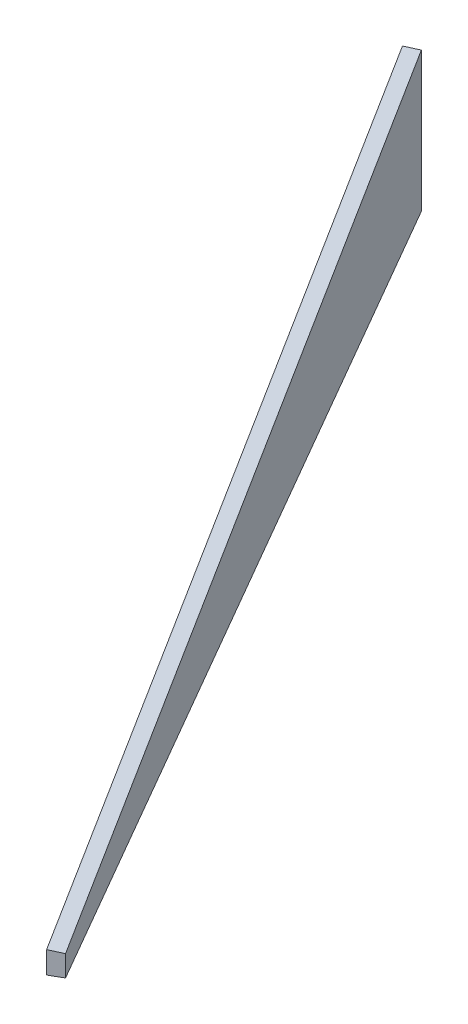
ISO-10303-21;
HEADER;
FILE_DESCRIPTION(('STEP AP214'),'2;1');
FILE_NAME('part.step','',(''),(''),'','','');
FILE_SCHEMA(('AUTOMOTIVE_DESIGN { 1 0 10303 214 1 1 1 1 }'));
ENDSEC;
DATA;
#1=APPLICATION_CONTEXT('core data for automotive mechanical design processes');
#2=APPLICATION_PROTOCOL_DEFINITION('international standard','automotive_design',2000,#1);
#3=PRODUCT_CONTEXT('',#1,'mechanical');
#4=PRODUCT('Part','Part','',(#3));
#5=PRODUCT_RELATED_PRODUCT_CATEGORY('part','',(#4));
#6=PRODUCT_DEFINITION_FORMATION('','',#4);
#7=PRODUCT_DEFINITION_CONTEXT('part definition',#1,'design');
#8=PRODUCT_DEFINITION('design','',#6,#7);
#9=PRODUCT_DEFINITION_SHAPE('','',#8);
#10=(LENGTH_UNIT() NAMED_UNIT(*) SI_UNIT(.MILLI.,.METRE.));
#11=(NAMED_UNIT(*) PLANE_ANGLE_UNIT() SI_UNIT($,.RADIAN.));
#12=(NAMED_UNIT(*) SI_UNIT($,.STERADIAN.) SOLID_ANGLE_UNIT());
#13=UNCERTAINTY_MEASURE_WITH_UNIT(LENGTH_MEASURE(1.E-05),#10,'distance_accuracy_value','');
#14=(GEOMETRIC_REPRESENTATION_CONTEXT(3) GLOBAL_UNCERTAINTY_ASSIGNED_CONTEXT((#13)) GLOBAL_UNIT_ASSIGNED_CONTEXT((#10,
#11,#12)) REPRESENTATION_CONTEXT('',''));
#15=CARTESIAN_POINT('',(0.,0.,0.));
#16=DIRECTION('',(0.,0.,1.));
#17=DIRECTION('',(1.,0.,0.));
#18=AXIS2_PLACEMENT_3D('',#15,#16,#17);
#19=CARTESIAN_POINT('',(469.9,0.,813.890674476508));
#20=DIRECTION('',(0.866025403784429,0.,-0.500000000000017));
#21=DIRECTION('',(-0.500000000000017,0.,-0.866025403784429));
#22=AXIS2_PLACEMENT_3D('',#19,#20,#21);
#23=PLANE('',#22);
#24=DIRECTION('',(-0.49632464230045,0.12102643422621,-0.859659497512718));
#25=VECTOR('',#24,1.);
#26=CARTESIAN_POINT('',(469.900000000001,19.3477043955137,813.890674476508));
#27=LINE('',#26,#25);
#28=CARTESIAN_POINT('',(469.900000000004,19.3477043955086,813.890674476514));
#29=VERTEX_POINT('',#28);
#30=CARTESIAN_POINT('',(23.6985226280685,128.151840137182,41.0470452561096));
#31=VERTEX_POINT('',#30);
#32=EDGE_CURVE('E55',#29,#31,#27,.T.);
#33=ORIENTED_EDGE('',*,*,#32,.F.);
#34=DIRECTION('',(0.,1.,0.));
#35=VECTOR('',#34,1.);
#36=CARTESIAN_POINT('',(469.900000000014,0.,813.890674476532));
#37=LINE('',#36,#35);
#38=CARTESIAN_POINT('',(469.900000000004,0.,813.890674476514));
#39=VERTEX_POINT('',#38);
#40=EDGE_CURVE('E67',#39,#29,#37,.T.);
#41=ORIENTED_EDGE('',*,*,#40,.F.);
#42=DIRECTION('',(-0.500000000000047,0.,-0.866025403784411));
#43=VECTOR('',#42,1.);
#44=CARTESIAN_POINT('',(469.9,0.,813.890674476508));
#45=LINE('',#44,#43);
#46=CARTESIAN_POINT('',(23.6985226280754,0.,41.0470452561057));
#47=VERTEX_POINT('',#46);
#48=EDGE_CURVE('E20',#39,#47,#45,.T.);
#49=ORIENTED_EDGE('',*,*,#48,.T.);
#50=DIRECTION('',(0.,1.,0.));
#51=VECTOR('',#50,1.);
#52=CARTESIAN_POINT('',(23.6985226280619,0.,41.0470452561136));
#53=LINE('',#52,#51);
#54=EDGE_CURVE('E80',#31,#47,#53,.F.);
#55=ORIENTED_EDGE('',*,*,#54,.F.);
#56=EDGE_LOOP('',(#33,#41,#49,#55));
#57=FACE_BOUND('',#56,.T.);
#58=ADVANCED_FACE('F17',(#57),#23,.T.);
#59=CARTESIAN_POINT('',(0.,0.,0.));
#60=DIRECTION('',(0.,1.,0.));
#61=DIRECTION('',(0.,0.,1.));
#62=AXIS2_PLACEMENT_3D('',#59,#60,#61);
#63=PLANE('',#62);
#64=ORIENTED_EDGE('',*,*,#48,.F.);
#65=DIRECTION('',(0.866025403784429,0.,-0.500000000000017));
#66=VECTOR('',#65,1.);
#67=CARTESIAN_POINT('',(458.901477371994,0.,820.240674476508));
#68=LINE('',#67,#66);
#69=CARTESIAN_POINT('',(458.901477371977,0.,820.240674476518));
#70=VERTEX_POINT('',#69);
#71=EDGE_CURVE('E62',#70,#39,#68,.T.);
#72=ORIENTED_EDGE('',*,*,#71,.F.);
#73=DIRECTION('',(0.500000000000017,0.,0.866025403784429));
#74=VECTOR('',#73,1.);
#75=CARTESIAN_POINT('',(12.7,0.,47.3970452561136));
#76=LINE('',#75,#74);
#77=CARTESIAN_POINT('',(12.7,0.,47.3970452561136));
#78=VERTEX_POINT('',#77);
#79=EDGE_CURVE('E83',#78,#70,#76,.T.);
#80=ORIENTED_EDGE('',*,*,#79,.F.);
#81=DIRECTION('',(-0.866025403784429,0.,0.500000000000017));
#82=VECTOR('',#81,1.);
#83=CARTESIAN_POINT('',(23.6985226280619,0.,41.0470452561136));
#84=LINE('',#83,#82);
#85=EDGE_CURVE('E65',#47,#78,#84,.T.);
#86=ORIENTED_EDGE('',*,*,#85,.F.);
#87=EDGE_LOOP('',(#64,#72,#80,#86));
#88=FACE_BOUND('',#87,.T.);
#89=ADVANCED_FACE('F60',(#88),#63,.F.);
#90=CARTESIAN_POINT('',(458.901477371994,0.,820.240674476508));
#91=DIRECTION('',(0.500000000000017,0.,0.866025403784429));
#92=DIRECTION('',(0.866025403784429,0.,-0.500000000000017));
#93=AXIS2_PLACEMENT_3D('',#90,#91,#92);
#94=PLANE('',#93);
#95=DIRECTION('',(0.863771850104166,-0.0720942990418863,-0.498698910178561));
#96=VECTOR('',#95,1.);
#97=CARTESIAN_POINT('',(458.901477371994,20.2656907587725,820.240674476508));
#98=LINE('',#97,#96);
#99=CARTESIAN_POINT('',(458.901477371977,20.2656907587715,820.240674476518));
#100=VERTEX_POINT('',#99);
#101=EDGE_CURVE('E77',#100,#29,#98,.T.);
#102=ORIENTED_EDGE('',*,*,#101,.F.);
#103=DIRECTION('',(0.,1.,0.));
#104=VECTOR('',#103,1.);
#105=CARTESIAN_POINT('',(458.901477371925,0.,820.240674476548));
#106=LINE('',#105,#104);
#107=EDGE_CURVE('E73',#70,#100,#106,.T.);
#108=ORIENTED_EDGE('',*,*,#107,.F.);
#109=ORIENTED_EDGE('',*,*,#71,.T.);
#110=ORIENTED_EDGE('',*,*,#40,.T.);
#111=EDGE_LOOP('',(#102,#108,#109,#110));
#112=FACE_BOUND('',#111,.T.);
#113=ADVANCED_FACE('F71',(#112),#94,.T.);
#114=CARTESIAN_POINT('',(241.3,74.2087654479838,430.64385986626));
#115=DIRECTION('',(0.122336956653803,0.990103922422821,0.0687596672449015));
#116=DIRECTION('',(-0.992452806793173,0.122627184132851,0.));
#117=AXIS2_PLACEMENT_3D('',#114,#115,#116);
#118=PLANE('',#117);
#119=DIRECTION('',(-0.496324642300419,0.121026434226214,-0.859659497512736));
#120=VECTOR('',#119,1.);
#121=CARTESIAN_POINT('',(458.901477371925,20.2656907587711,820.240674476548));
#122=LINE('',#121,#120);
#123=CARTESIAN_POINT('',(12.7000000000001,129.069826500446,47.3970452561137));
#124=VERTEX_POINT('',#123);
#125=EDGE_CURVE('E26',#100,#124,#122,.T.);
#126=ORIENTED_EDGE('',*,*,#125,.F.);
#127=ORIENTED_EDGE('',*,*,#101,.T.);
#128=ORIENTED_EDGE('',*,*,#32,.T.);
#129=DIRECTION('',(0.863771850105242,-0.0720942990418345,-0.498698910176705));
#130=VECTOR('',#129,1.);
#131=CARTESIAN_POINT('',(12.7,129.069826500445,47.3970452561136));
#132=LINE('',#131,#130);
#133=EDGE_CURVE('E35',#124,#31,#132,.T.);
#134=ORIENTED_EDGE('',*,*,#133,.F.);
#135=EDGE_LOOP('',(#126,#127,#128,#134));
#136=FACE_BOUND('',#135,.T.);
#137=ADVANCED_FACE('F89',(#136),#118,.T.);
#138=CARTESIAN_POINT('',(23.6985226280619,0.,41.0470452561136));
#139=DIRECTION('',(-0.500000000000017,0.,-0.866025403784429));
#140=DIRECTION('',(-0.866025403784429,0.,0.500000000000017));
#141=AXIS2_PLACEMENT_3D('',#138,#139,#140);
#142=PLANE('',#141);
#143=ORIENTED_EDGE('',*,*,#85,.T.);
#144=DIRECTION('',(0.,1.,0.));
#145=VECTOR('',#144,1.);
#146=CARTESIAN_POINT('',(12.7,0.,47.3970452561136));
#147=LINE('',#146,#145);
#148=EDGE_CURVE('E11',#124,#78,#147,.F.);
#149=ORIENTED_EDGE('',*,*,#148,.F.);
#150=ORIENTED_EDGE('',*,*,#133,.T.);
#151=ORIENTED_EDGE('',*,*,#54,.T.);
#152=EDGE_LOOP('',(#143,#149,#150,#151));
#153=FACE_BOUND('',#152,.T.);
#154=ADVANCED_FACE('F91',(#153),#142,.T.);
#155=CARTESIAN_POINT('',(12.7,0.,47.3970452561136));
#156=DIRECTION('',(-0.866025403784429,0.,0.500000000000017));
#157=DIRECTION('',(0.500000000000017,0.,0.866025403784429));
#158=AXIS2_PLACEMENT_3D('',#155,#156,#157);
#159=PLANE('',#158);
#160=ORIENTED_EDGE('',*,*,#125,.T.);
#161=ORIENTED_EDGE('',*,*,#148,.T.);
#162=ORIENTED_EDGE('',*,*,#79,.T.);
#163=ORIENTED_EDGE('',*,*,#107,.T.);
#164=EDGE_LOOP('',(#160,#161,#162,#163));
#165=FACE_BOUND('',#164,.T.);
#166=ADVANCED_FACE('F88',(#165),#159,.T.);
#167=CLOSED_SHELL('',(#58,#89,#113,#137,#154,#166));
#168=MANIFOLD_SOLID_BREP('B1',#167);
#169=ADVANCED_BREP_SHAPE_REPRESENTATION('',(#18,#168),#14);
#170=SHAPE_DEFINITION_REPRESENTATION(#9,#169);
ENDSEC;
END-ISO-10303-21;
